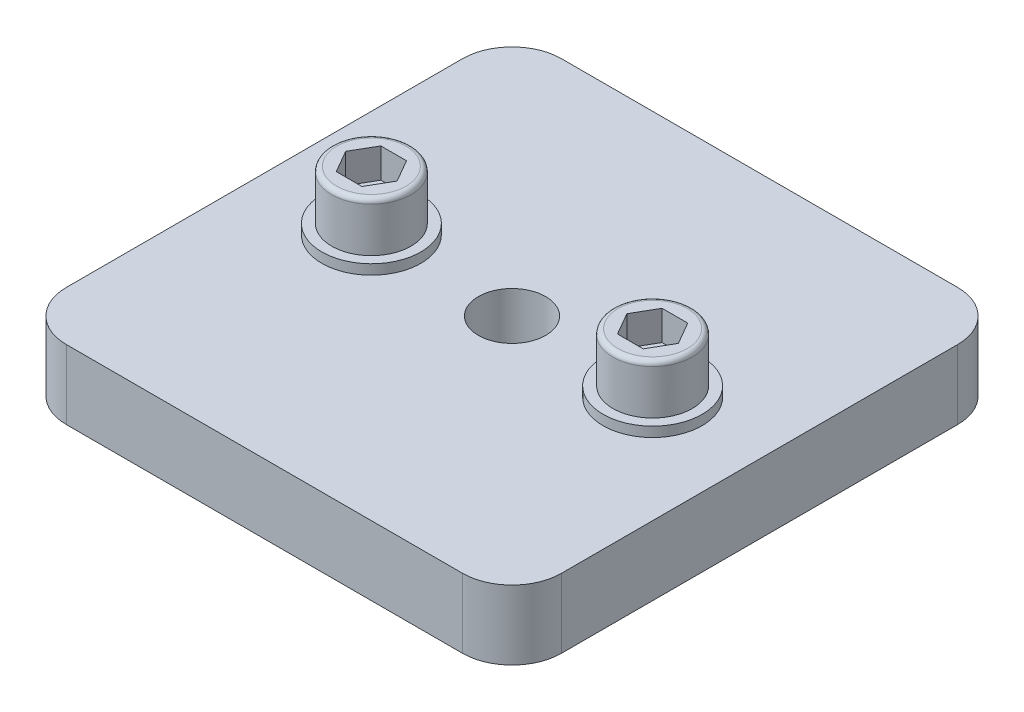
ISO-10303-21;
HEADER;
FILE_DESCRIPTION(('STEP AP214'),'2;1');
FILE_NAME('part.step','',(''),(''),'','','');
FILE_SCHEMA(('AUTOMOTIVE_DESIGN { 1 0 10303 214 1 1 1 1 }'));
ENDSEC;
DATA;
#1=APPLICATION_CONTEXT('core data for automotive mechanical design processes');
#2=APPLICATION_PROTOCOL_DEFINITION('international standard','automotive_design',2000,#1);
#3=PRODUCT_CONTEXT('',#1,'mechanical');
#4=PRODUCT('Part','Part','',(#3));
#5=PRODUCT_RELATED_PRODUCT_CATEGORY('part','',(#4));
#6=PRODUCT_DEFINITION_FORMATION('','',#4);
#7=PRODUCT_DEFINITION_CONTEXT('part definition',#1,'design');
#8=PRODUCT_DEFINITION('design','',#6,#7);
#9=PRODUCT_DEFINITION_SHAPE('','',#8);
#10=(LENGTH_UNIT() NAMED_UNIT(*) SI_UNIT(.MILLI.,.METRE.));
#11=(NAMED_UNIT(*) PLANE_ANGLE_UNIT() SI_UNIT($,.RADIAN.));
#12=(NAMED_UNIT(*) SI_UNIT($,.STERADIAN.) SOLID_ANGLE_UNIT());
#13=UNCERTAINTY_MEASURE_WITH_UNIT(LENGTH_MEASURE(1.E-05),#10,'distance_accuracy_value','');
#14=(GEOMETRIC_REPRESENTATION_CONTEXT(3) GLOBAL_UNCERTAINTY_ASSIGNED_CONTEXT((#13)) GLOBAL_UNIT_ASSIGNED_CONTEXT((#10,
#11,#12)) REPRESENTATION_CONTEXT('',''));
#15=CARTESIAN_POINT('',(0.,0.,0.));
#16=DIRECTION('',(0.,0.,1.));
#17=DIRECTION('',(1.,0.,0.));
#18=AXIS2_PLACEMENT_3D('',#15,#16,#17);
#19=CARTESIAN_POINT('',(-20.,7.,-20.));
#20=DIRECTION('',(0.,1.,0.));
#21=DIRECTION('',(0.,0.,1.));
#22=AXIS2_PLACEMENT_3D('',#19,#20,#21);
#23=PLANE('',#22);
#24=CARTESIAN_POINT('',(-20.,7.,-20.));
#25=DIRECTION('',(0.,1.,0.));
#26=DIRECTION('',(0.,0.,1.));
#27=AXIS2_PLACEMENT_3D('',#24,#25,#26);
#28=CIRCLE('',#27,5.);
#29=CARTESIAN_POINT('',(-20.,7.,-25.));
#30=VERTEX_POINT('',#29);
#31=CARTESIAN_POINT('',(-25.,7.,-20.));
#32=VERTEX_POINT('',#31);
#33=EDGE_CURVE('E297',#30,#32,#28,.T.);
#34=ORIENTED_EDGE('',*,*,#33,.T.);
#35=DIRECTION('',(0.,0.,1.));
#36=VECTOR('',#35,1.);
#37=CARTESIAN_POINT('',(-25.,7.,20.));
#38=LINE('',#37,#36);
#39=CARTESIAN_POINT('',(-25.,7.,20.));
#40=VERTEX_POINT('',#39);
#41=EDGE_CURVE('E299',#32,#40,#38,.T.);
#42=ORIENTED_EDGE('',*,*,#41,.T.);
#43=CARTESIAN_POINT('',(-20.,7.,20.));
#44=DIRECTION('',(0.,1.,0.));
#45=DIRECTION('',(0.,0.,-1.));
#46=AXIS2_PLACEMENT_3D('',#43,#44,#45);
#47=CIRCLE('',#46,5.);
#48=CARTESIAN_POINT('',(-20.,7.,25.));
#49=VERTEX_POINT('',#48);
#50=EDGE_CURVE('E302',#40,#49,#47,.T.);
#51=ORIENTED_EDGE('',*,*,#50,.T.);
#52=DIRECTION('',(1.,0.,0.));
#53=VECTOR('',#52,1.);
#54=CARTESIAN_POINT('',(20.,7.,25.));
#55=LINE('',#54,#53);
#56=CARTESIAN_POINT('',(20.,7.,25.));
#57=VERTEX_POINT('',#56);
#58=EDGE_CURVE('E304',#49,#57,#55,.T.);
#59=ORIENTED_EDGE('',*,*,#58,.T.);
#60=CARTESIAN_POINT('',(20.,7.,20.));
#61=DIRECTION('',(0.,1.,0.));
#62=DIRECTION('',(0.,0.,1.));
#63=AXIS2_PLACEMENT_3D('',#60,#61,#62);
#64=CIRCLE('',#63,5.);
#65=CARTESIAN_POINT('',(25.,7.,20.));
#66=VERTEX_POINT('',#65);
#67=EDGE_CURVE('E306',#57,#66,#64,.T.);
#68=ORIENTED_EDGE('',*,*,#67,.T.);
#69=DIRECTION('',(0.,0.,-1.));
#70=VECTOR('',#69,1.);
#71=CARTESIAN_POINT('',(25.,7.,20.));
#72=LINE('',#71,#70);
#73=CARTESIAN_POINT('',(25.,7.,-20.));
#74=VERTEX_POINT('',#73);
#75=EDGE_CURVE('E308',#66,#74,#72,.T.);
#76=ORIENTED_EDGE('',*,*,#75,.T.);
#77=CARTESIAN_POINT('',(20.,7.,-20.));
#78=DIRECTION('',(0.,1.,0.));
#79=DIRECTION('',(0.,0.,1.));
#80=AXIS2_PLACEMENT_3D('',#77,#78,#79);
#81=CIRCLE('',#80,5.);
#82=CARTESIAN_POINT('',(20.,7.,-25.));
#83=VERTEX_POINT('',#82);
#84=EDGE_CURVE('E310',#74,#83,#81,.T.);
#85=ORIENTED_EDGE('',*,*,#84,.T.);
#86=DIRECTION('',(-1.,0.,0.));
#87=VECTOR('',#86,1.);
#88=CARTESIAN_POINT('',(20.,7.,-25.));
#89=LINE('',#88,#87);
#90=EDGE_CURVE('E312',#83,#30,#89,.T.);
#91=ORIENTED_EDGE('',*,*,#90,.T.);
#92=EDGE_LOOP('',(#34,#42,#51,#59,#68,#76,#85,#91));
#93=FACE_BOUND('',#92,.T.);
#94=CARTESIAN_POINT('',(-14.2,7.,0.));
#95=DIRECTION('',(0.,1.,0.));
#96=DIRECTION('',(-1.,0.,0.));
#97=AXIS2_PLACEMENT_3D('',#94,#95,#96);
#98=CIRCLE('',#97,5.);
#99=CARTESIAN_POINT('',(-19.2,7.,0.));
#100=VERTEX_POINT('',#99);
#101=EDGE_CURVE('E218',#100,#100,#98,.T.);
#102=ORIENTED_EDGE('',*,*,#101,.F.);
#103=EDGE_LOOP('',(#102));
#104=FACE_BOUND('',#103,.T.);
#105=CARTESIAN_POINT('',(14.2,7.,0.));
#106=DIRECTION('',(0.,1.,0.));
#107=DIRECTION('',(-1.,0.,0.));
#108=AXIS2_PLACEMENT_3D('',#105,#106,#107);
#109=CIRCLE('',#108,5.);
#110=CARTESIAN_POINT('',(9.2,7.,0.));
#111=VERTEX_POINT('',#110);
#112=EDGE_CURVE('E282',#111,#111,#109,.T.);
#113=ORIENTED_EDGE('',*,*,#112,.F.);
#114=EDGE_LOOP('',(#113));
#115=FACE_BOUND('',#114,.T.);
#116=CARTESIAN_POINT('',(0.,7.,0.));
#117=DIRECTION('',(0.,1.,0.));
#118=DIRECTION('',(0.,0.,1.));
#119=AXIS2_PLACEMENT_3D('',#116,#117,#118);
#120=CIRCLE('',#119,3.4);
#121=CARTESIAN_POINT('',(0.,7.,3.4));
#122=VERTEX_POINT('',#121);
#123=EDGE_CURVE('E288',#122,#122,#120,.T.);
#124=ORIENTED_EDGE('',*,*,#123,.F.);
#125=EDGE_LOOP('',(#124));
#126=FACE_BOUND('',#125,.T.);
#127=ADVANCED_FACE('F33',(#93,#104,#115,#126),#23,.T.);
#128=CARTESIAN_POINT('',(-20.,0.,-20.));
#129=DIRECTION('',(0.,1.,0.));
#130=DIRECTION('',(0.,0.,1.));
#131=AXIS2_PLACEMENT_3D('',#128,#129,#130);
#132=PLANE('',#131);
#133=CARTESIAN_POINT('',(0.,0.,0.));
#134=DIRECTION('',(0.,1.,0.));
#135=DIRECTION('',(0.,0.,1.));
#136=AXIS2_PLACEMENT_3D('',#133,#134,#135);
#137=CIRCLE('',#136,3.4);
#138=CARTESIAN_POINT('',(0.,0.,3.4));
#139=VERTEX_POINT('',#138);
#140=EDGE_CURVE('E291',#139,#139,#137,.T.);
#141=ORIENTED_EDGE('',*,*,#140,.T.);
#142=EDGE_LOOP('',(#141));
#143=FACE_BOUND('',#142,.T.);
#144=CARTESIAN_POINT('',(-20.,0.,-20.));
#145=DIRECTION('',(0.,1.,0.));
#146=DIRECTION('',(0.,0.,1.));
#147=AXIS2_PLACEMENT_3D('',#144,#145,#146);
#148=CIRCLE('',#147,5.);
#149=CARTESIAN_POINT('',(-20.,0.,-25.));
#150=VERTEX_POINT('',#149);
#151=CARTESIAN_POINT('',(-25.,0.,-20.));
#152=VERTEX_POINT('',#151);
#153=EDGE_CURVE('E294',#150,#152,#148,.T.);
#154=ORIENTED_EDGE('',*,*,#153,.F.);
#155=DIRECTION('',(-1.,0.,0.));
#156=VECTOR('',#155,1.);
#157=CARTESIAN_POINT('',(20.,0.,-25.));
#158=LINE('',#157,#156);
#159=CARTESIAN_POINT('',(20.,0.,-25.));
#160=VERTEX_POINT('',#159);
#161=EDGE_CURVE('E300',#160,#150,#158,.T.);
#162=ORIENTED_EDGE('',*,*,#161,.F.);
#163=CARTESIAN_POINT('',(20.,0.,-20.));
#164=DIRECTION('',(0.,1.,0.));
#165=DIRECTION('',(0.,0.,1.));
#166=AXIS2_PLACEMENT_3D('',#163,#164,#165);
#167=CIRCLE('',#166,5.);
#168=CARTESIAN_POINT('',(25.,0.,-20.));
#169=VERTEX_POINT('',#168);
#170=EDGE_CURVE('E327',#169,#160,#167,.T.);
#171=ORIENTED_EDGE('',*,*,#170,.F.);
#172=DIRECTION('',(0.,0.,-1.));
#173=VECTOR('',#172,1.);
#174=CARTESIAN_POINT('',(25.,0.,20.));
#175=LINE('',#174,#173);
#176=CARTESIAN_POINT('',(25.,0.,20.));
#177=VERTEX_POINT('',#176);
#178=EDGE_CURVE('E325',#177,#169,#175,.T.);
#179=ORIENTED_EDGE('',*,*,#178,.F.);
#180=CARTESIAN_POINT('',(20.,0.,20.));
#181=DIRECTION('',(0.,1.,0.));
#182=DIRECTION('',(0.,0.,1.));
#183=AXIS2_PLACEMENT_3D('',#180,#181,#182);
#184=CIRCLE('',#183,5.);
#185=CARTESIAN_POINT('',(20.,0.,25.));
#186=VERTEX_POINT('',#185);
#187=EDGE_CURVE('E323',#186,#177,#184,.T.);
#188=ORIENTED_EDGE('',*,*,#187,.F.);
#189=DIRECTION('',(1.,0.,0.));
#190=VECTOR('',#189,1.);
#191=CARTESIAN_POINT('',(20.,0.,25.));
#192=LINE('',#191,#190);
#193=CARTESIAN_POINT('',(-20.,0.,25.));
#194=VERTEX_POINT('',#193);
#195=EDGE_CURVE('E321',#194,#186,#192,.T.);
#196=ORIENTED_EDGE('',*,*,#195,.F.);
#197=CARTESIAN_POINT('',(-20.,0.,20.));
#198=DIRECTION('',(0.,1.,0.));
#199=DIRECTION('',(0.,0.,-1.));
#200=AXIS2_PLACEMENT_3D('',#197,#198,#199);
#201=CIRCLE('',#200,5.);
#202=CARTESIAN_POINT('',(-25.,0.,20.));
#203=VERTEX_POINT('',#202);
#204=EDGE_CURVE('E319',#203,#194,#201,.T.);
#205=ORIENTED_EDGE('',*,*,#204,.F.);
#206=DIRECTION('',(0.,0.,1.));
#207=VECTOR('',#206,1.);
#208=CARTESIAN_POINT('',(-25.,0.,20.));
#209=LINE('',#208,#207);
#210=EDGE_CURVE('E317',#152,#203,#209,.T.);
#211=ORIENTED_EDGE('',*,*,#210,.F.);
#212=EDGE_LOOP('',(#154,#162,#171,#179,#188,#196,#205,#211));
#213=FACE_BOUND('',#212,.T.);
#214=ADVANCED_FACE('F371',(#143,#213),#132,.F.);
#215=CARTESIAN_POINT('',(-20.,7.,-20.));
#216=DIRECTION('',(0.,-1.,0.));
#217=DIRECTION('',(0.,0.,-1.));
#218=AXIS2_PLACEMENT_3D('',#215,#216,#217);
#219=CYLINDRICAL_SURFACE('',#218,5.);
#220=ORIENTED_EDGE('',*,*,#153,.T.);
#221=DIRECTION('',(0.,-1.,0.));
#222=VECTOR('',#221,1.);
#223=CARTESIAN_POINT('',(-25.,7.,-20.));
#224=LINE('',#223,#222);
#225=EDGE_CURVE('E278',#32,#152,#224,.T.);
#226=ORIENTED_EDGE('',*,*,#225,.F.);
#227=ORIENTED_EDGE('',*,*,#33,.F.);
#228=DIRECTION('',(0.,-1.,0.));
#229=VECTOR('',#228,1.);
#230=CARTESIAN_POINT('',(-20.,7.,-25.));
#231=LINE('',#230,#229);
#232=EDGE_CURVE('E314',#30,#150,#231,.T.);
#233=ORIENTED_EDGE('',*,*,#232,.T.);
#234=EDGE_LOOP('',(#220,#226,#227,#233));
#235=FACE_BOUND('',#234,.T.);
#236=ADVANCED_FACE('F379',(#235),#219,.T.);
#237=CARTESIAN_POINT('',(-25.,7.,20.));
#238=DIRECTION('',(1.,0.,0.));
#239=DIRECTION('',(0.,0.,-1.));
#240=AXIS2_PLACEMENT_3D('',#237,#238,#239);
#241=PLANE('',#240);
#242=ORIENTED_EDGE('',*,*,#210,.T.);
#243=DIRECTION('',(0.,-1.,0.));
#244=VECTOR('',#243,1.);
#245=CARTESIAN_POINT('',(-25.,7.,20.));
#246=LINE('',#245,#244);
#247=EDGE_CURVE('E347',#40,#203,#246,.T.);
#248=ORIENTED_EDGE('',*,*,#247,.F.);
#249=ORIENTED_EDGE('',*,*,#41,.F.);
#250=ORIENTED_EDGE('',*,*,#225,.T.);
#251=EDGE_LOOP('',(#242,#248,#249,#250));
#252=FACE_BOUND('',#251,.T.);
#253=ADVANCED_FACE('F410',(#252),#241,.F.);
#254=CARTESIAN_POINT('',(-20.,7.,20.));
#255=DIRECTION('',(0.,-1.,0.));
#256=DIRECTION('',(0.,0.,-1.));
#257=AXIS2_PLACEMENT_3D('',#254,#255,#256);
#258=CYLINDRICAL_SURFACE('',#257,5.);
#259=ORIENTED_EDGE('',*,*,#204,.T.);
#260=DIRECTION('',(0.,-1.,0.));
#261=VECTOR('',#260,1.);
#262=CARTESIAN_POINT('',(-20.,7.,25.));
#263=LINE('',#262,#261);
#264=EDGE_CURVE('E344',#49,#194,#263,.T.);
#265=ORIENTED_EDGE('',*,*,#264,.F.);
#266=ORIENTED_EDGE('',*,*,#50,.F.);
#267=ORIENTED_EDGE('',*,*,#247,.T.);
#268=EDGE_LOOP('',(#259,#265,#266,#267));
#269=FACE_BOUND('',#268,.T.);
#270=ADVANCED_FACE('F406',(#269),#258,.T.);
#271=CARTESIAN_POINT('',(20.,7.,25.));
#272=DIRECTION('',(0.,0.,-1.));
#273=DIRECTION('',(-1.,0.,0.));
#274=AXIS2_PLACEMENT_3D('',#271,#272,#273);
#275=PLANE('',#274);
#276=ORIENTED_EDGE('',*,*,#195,.T.);
#277=DIRECTION('',(0.,-1.,0.));
#278=VECTOR('',#277,1.);
#279=CARTESIAN_POINT('',(20.,7.,25.));
#280=LINE('',#279,#278);
#281=EDGE_CURVE('E341',#57,#186,#280,.T.);
#282=ORIENTED_EDGE('',*,*,#281,.F.);
#283=ORIENTED_EDGE('',*,*,#58,.F.);
#284=ORIENTED_EDGE('',*,*,#264,.T.);
#285=EDGE_LOOP('',(#276,#282,#283,#284));
#286=FACE_BOUND('',#285,.T.);
#287=ADVANCED_FACE('F402',(#286),#275,.F.);
#288=CARTESIAN_POINT('',(20.,7.,20.));
#289=DIRECTION('',(0.,-1.,0.));
#290=DIRECTION('',(0.,0.,-1.));
#291=AXIS2_PLACEMENT_3D('',#288,#289,#290);
#292=CYLINDRICAL_SURFACE('',#291,5.);
#293=ORIENTED_EDGE('',*,*,#187,.T.);
#294=DIRECTION('',(0.,-1.,0.));
#295=VECTOR('',#294,1.);
#296=CARTESIAN_POINT('',(25.,7.,20.));
#297=LINE('',#296,#295);
#298=EDGE_CURVE('E338',#66,#177,#297,.T.);
#299=ORIENTED_EDGE('',*,*,#298,.F.);
#300=ORIENTED_EDGE('',*,*,#67,.F.);
#301=ORIENTED_EDGE('',*,*,#281,.T.);
#302=EDGE_LOOP('',(#293,#299,#300,#301));
#303=FACE_BOUND('',#302,.T.);
#304=ADVANCED_FACE('F398',(#303),#292,.T.);
#305=CARTESIAN_POINT('',(25.,7.,20.));
#306=DIRECTION('',(-1.,0.,0.));
#307=DIRECTION('',(0.,0.,1.));
#308=AXIS2_PLACEMENT_3D('',#305,#306,#307);
#309=PLANE('',#308);
#310=ORIENTED_EDGE('',*,*,#178,.T.);
#311=DIRECTION('',(0.,-1.,0.));
#312=VECTOR('',#311,1.);
#313=CARTESIAN_POINT('',(25.,7.,-20.));
#314=LINE('',#313,#312);
#315=EDGE_CURVE('E335',#74,#169,#314,.T.);
#316=ORIENTED_EDGE('',*,*,#315,.F.);
#317=ORIENTED_EDGE('',*,*,#75,.F.);
#318=ORIENTED_EDGE('',*,*,#298,.T.);
#319=EDGE_LOOP('',(#310,#316,#317,#318));
#320=FACE_BOUND('',#319,.T.);
#321=ADVANCED_FACE('F394',(#320),#309,.F.);
#322=CARTESIAN_POINT('',(20.,7.,-20.));
#323=DIRECTION('',(0.,-1.,0.));
#324=DIRECTION('',(0.,0.,-1.));
#325=AXIS2_PLACEMENT_3D('',#322,#323,#324);
#326=CYLINDRICAL_SURFACE('',#325,5.);
#327=ORIENTED_EDGE('',*,*,#170,.T.);
#328=DIRECTION('',(0.,-1.,0.));
#329=VECTOR('',#328,1.);
#330=CARTESIAN_POINT('',(20.,7.,-25.));
#331=LINE('',#330,#329);
#332=EDGE_CURVE('E332',#83,#160,#331,.T.);
#333=ORIENTED_EDGE('',*,*,#332,.F.);
#334=ORIENTED_EDGE('',*,*,#84,.F.);
#335=ORIENTED_EDGE('',*,*,#315,.T.);
#336=EDGE_LOOP('',(#327,#333,#334,#335));
#337=FACE_BOUND('',#336,.T.);
#338=ADVANCED_FACE('F390',(#337),#326,.T.);
#339=CARTESIAN_POINT('',(20.,7.,-25.));
#340=DIRECTION('',(0.,0.,1.));
#341=DIRECTION('',(1.,0.,0.));
#342=AXIS2_PLACEMENT_3D('',#339,#340,#341);
#343=PLANE('',#342);
#344=ORIENTED_EDGE('',*,*,#161,.T.);
#345=ORIENTED_EDGE('',*,*,#232,.F.);
#346=ORIENTED_EDGE('',*,*,#90,.F.);
#347=ORIENTED_EDGE('',*,*,#332,.T.);
#348=EDGE_LOOP('',(#344,#345,#346,#347));
#349=FACE_BOUND('',#348,.T.);
#350=ADVANCED_FACE('F387',(#349),#343,.F.);
#351=CARTESIAN_POINT('',(0.,0.,0.));
#352=DIRECTION('',(0.,1.,0.));
#353=DIRECTION('',(0.,0.,1.));
#354=AXIS2_PLACEMENT_3D('',#351,#352,#353);
#355=CYLINDRICAL_SURFACE('',#354,3.4);
#356=ORIENTED_EDGE('',*,*,#140,.F.);
#357=EDGE_LOOP('',(#356));
#358=FACE_BOUND('',#357,.T.);
#359=ORIENTED_EDGE('',*,*,#123,.T.);
#360=EDGE_LOOP('',(#359));
#361=FACE_BOUND('',#360,.T.);
#362=ADVANCED_FACE('F384',(#358,#361),#355,.F.);
#363=CARTESIAN_POINT('',(14.2,8.,0.));
#364=DIRECTION('',(0.,-1.,0.));
#365=DIRECTION('',(0.,0.,-1.));
#366=AXIS2_PLACEMENT_3D('',#363,#364,#365);
#367=CYLINDRICAL_SURFACE('',#366,5.);
#368=CARTESIAN_POINT('',(14.2,8.,0.));
#369=DIRECTION('',(0.,1.,0.));
#370=DIRECTION('',(-1.,0.,0.));
#371=AXIS2_PLACEMENT_3D('',#368,#369,#370);
#372=CIRCLE('',#371,5.);
#373=CARTESIAN_POINT('',(9.2,8.,0.));
#374=VERTEX_POINT('',#373);
#375=EDGE_CURVE('E285',#374,#374,#372,.T.);
#376=ORIENTED_EDGE('',*,*,#375,.F.);
#377=EDGE_LOOP('',(#376));
#378=FACE_BOUND('',#377,.T.);
#379=ORIENTED_EDGE('',*,*,#112,.T.);
#380=EDGE_LOOP('',(#379));
#381=FACE_BOUND('',#380,.T.);
#382=ADVANCED_FACE('F476',(#378,#381),#367,.T.);
#383=CARTESIAN_POINT('',(14.2,8.,0.));
#384=DIRECTION('',(0.,1.,0.));
#385=DIRECTION('',(-1.,0.,0.));
#386=AXIS2_PLACEMENT_3D('',#383,#384,#385);
#387=PLANE('',#386);
#388=CARTESIAN_POINT('',(14.2,8.,0.));
#389=DIRECTION('',(0.,1.,0.));
#390=DIRECTION('',(-1.,0.,0.));
#391=AXIS2_PLACEMENT_3D('',#388,#389,#390);
#392=CIRCLE('',#391,4.);
#393=CARTESIAN_POINT('',(10.2,8.,0.));
#394=VERTEX_POINT('',#393);
#395=EDGE_CURVE('E275',#394,#394,#392,.T.);
#396=ORIENTED_EDGE('',*,*,#395,.F.);
#397=EDGE_LOOP('',(#396));
#398=FACE_BOUND('',#397,.T.);
#399=ORIENTED_EDGE('',*,*,#375,.T.);
#400=EDGE_LOOP('',(#399));
#401=FACE_BOUND('',#400,.T.);
#402=ADVANCED_FACE('F500',(#398,#401),#387,.T.);
#403=CARTESIAN_POINT('',(-14.2,8.,0.));
#404=DIRECTION('',(0.,-1.,0.));
#405=DIRECTION('',(0.,0.,-1.));
#406=AXIS2_PLACEMENT_3D('',#403,#404,#405);
#407=CYLINDRICAL_SURFACE('',#406,5.);
#408=CARTESIAN_POINT('',(-14.2,8.,0.));
#409=DIRECTION('',(0.,1.,0.));
#410=DIRECTION('',(-1.,0.,0.));
#411=AXIS2_PLACEMENT_3D('',#408,#409,#410);
#412=CIRCLE('',#411,5.);
#413=CARTESIAN_POINT('',(-19.2,8.,0.));
#414=VERTEX_POINT('',#413);
#415=EDGE_CURVE('E279',#414,#414,#412,.T.);
#416=ORIENTED_EDGE('',*,*,#415,.F.);
#417=EDGE_LOOP('',(#416));
#418=FACE_BOUND('',#417,.T.);
#419=ORIENTED_EDGE('',*,*,#101,.T.);
#420=EDGE_LOOP('',(#419));
#421=FACE_BOUND('',#420,.T.);
#422=ADVANCED_FACE('F509',(#418,#421),#407,.T.);
#423=CARTESIAN_POINT('',(-14.2,8.,0.));
#424=DIRECTION('',(0.,1.,0.));
#425=DIRECTION('',(-1.,0.,0.));
#426=AXIS2_PLACEMENT_3D('',#423,#424,#425);
#427=PLANE('',#426);
#428=CARTESIAN_POINT('',(-14.2,8.,0.));
#429=DIRECTION('',(0.,1.,0.));
#430=DIRECTION('',(-1.,0.,0.));
#431=AXIS2_PLACEMENT_3D('',#428,#429,#430);
#432=CIRCLE('',#431,4.);
#433=CARTESIAN_POINT('',(-18.2,8.,0.));
#434=VERTEX_POINT('',#433);
#435=EDGE_CURVE('E271',#434,#434,#432,.T.);
#436=ORIENTED_EDGE('',*,*,#435,.F.);
#437=EDGE_LOOP('',(#436));
#438=FACE_BOUND('',#437,.T.);
#439=ORIENTED_EDGE('',*,*,#415,.T.);
#440=EDGE_LOOP('',(#439));
#441=FACE_BOUND('',#440,.T.);
#442=ADVANCED_FACE('F519',(#438,#441),#427,.T.);
#443=CARTESIAN_POINT('',(14.2,13.,0.));
#444=DIRECTION('',(0.,-1.,0.));
#445=DIRECTION('',(0.,0.,-1.));
#446=AXIS2_PLACEMENT_3D('',#443,#444,#445);
#447=CYLINDRICAL_SURFACE('',#446,4.);
#448=CARTESIAN_POINT('',(14.2,12.5,0.));
#449=DIRECTION('',(0.,1.,0.));
#450=DIRECTION('',(0.,0.,1.));
#451=AXIS2_PLACEMENT_3D('',#448,#449,#450);
#452=CIRCLE('',#451,4.);
#453=CARTESIAN_POINT('',(14.2,12.5,4.00000000000005));
#454=VERTEX_POINT('',#453);
#455=EDGE_CURVE('E11',#454,#454,#452,.F.);
#456=ORIENTED_EDGE('',*,*,#455,.T.);
#457=EDGE_LOOP('',(#456));
#458=FACE_BOUND('',#457,.T.);
#459=ORIENTED_EDGE('',*,*,#395,.T.);
#460=EDGE_LOOP('',(#459));
#461=FACE_BOUND('',#460,.T.);
#462=ADVANCED_FACE('F529',(#458,#461),#447,.T.);
#463=CARTESIAN_POINT('',(14.2,13.,0.));
#464=DIRECTION('',(0.,1.,0.));
#465=DIRECTION('',(-1.,0.,0.));
#466=AXIS2_PLACEMENT_3D('',#463,#464,#465);
#467=PLANE('',#466);
#468=CARTESIAN_POINT('',(14.2,13.,0.));
#469=DIRECTION('',(0.,1.,0.));
#470=DIRECTION('',(0.,0.,1.));
#471=AXIS2_PLACEMENT_3D('',#468,#469,#470);
#472=CIRCLE('',#471,3.5);
#473=CARTESIAN_POINT('',(14.2,13.,3.50000000000005));
#474=VERTEX_POINT('',#473);
#475=EDGE_CURVE('E41',#474,#474,#472,.T.);
#476=ORIENTED_EDGE('',*,*,#475,.T.);
#477=EDGE_LOOP('',(#476));
#478=FACE_BOUND('',#477,.T.);
#479=DIRECTION('',(0.500000000000003,0.,-0.866025403784437));
#480=VECTOR('',#479,1.);
#481=CARTESIAN_POINT('',(15.4990381056767,13.,2.25000000000005));
#482=LINE('',#481,#480);
#483=CARTESIAN_POINT('',(15.4990381056767,13.,2.25000000000005));
#484=VERTEX_POINT('',#483);
#485=CARTESIAN_POINT('',(16.7980762113533,13.,0.));
#486=VERTEX_POINT('',#485);
#487=EDGE_CURVE('E48',#484,#486,#482,.T.);
#488=ORIENTED_EDGE('',*,*,#487,.F.);
#489=DIRECTION('',(1.,0.,0.));
#490=VECTOR('',#489,1.);
#491=CARTESIAN_POINT('',(12.9009618943233,13.,2.25000000000005));
#492=LINE('',#491,#490);
#493=CARTESIAN_POINT('',(12.9009618943233,13.,2.25000000000005));
#494=VERTEX_POINT('',#493);
#495=EDGE_CURVE('E191',#494,#484,#492,.T.);
#496=ORIENTED_EDGE('',*,*,#495,.F.);
#497=DIRECTION('',(0.499999999999997,0.,0.86602540378444));
#498=VECTOR('',#497,1.);
#499=CARTESIAN_POINT('',(11.6019237886467,13.,0.));
#500=LINE('',#499,#498);
#501=CARTESIAN_POINT('',(11.6019237886467,13.,0.));
#502=VERTEX_POINT('',#501);
#503=EDGE_CURVE('E194',#502,#494,#500,.T.);
#504=ORIENTED_EDGE('',*,*,#503,.F.);
#505=DIRECTION('',(-0.500000000000003,0.,0.866025403784437));
#506=VECTOR('',#505,1.);
#507=CARTESIAN_POINT('',(12.9009618943234,13.,-2.24999999999995));
#508=LINE('',#507,#506);
#509=CARTESIAN_POINT('',(12.9009618943234,13.,-2.24999999999995));
#510=VERTEX_POINT('',#509);
#511=EDGE_CURVE('E211',#510,#502,#508,.T.);
#512=ORIENTED_EDGE('',*,*,#511,.F.);
#513=DIRECTION('',(-1.,0.,0.));
#514=VECTOR('',#513,1.);
#515=CARTESIAN_POINT('',(15.4990381056767,13.,-2.24999999999994));
#516=LINE('',#515,#514);
#517=CARTESIAN_POINT('',(15.4990381056767,13.,-2.24999999999994));
#518=VERTEX_POINT('',#517);
#519=EDGE_CURVE('E208',#518,#510,#516,.T.);
#520=ORIENTED_EDGE('',*,*,#519,.F.);
#521=DIRECTION('',(-0.499999999999998,0.,-0.86602540378444));
#522=VECTOR('',#521,1.);
#523=CARTESIAN_POINT('',(16.7980762113533,13.,0.));
#524=LINE('',#523,#522);
#525=EDGE_CURVE('E205',#486,#518,#524,.T.);
#526=ORIENTED_EDGE('',*,*,#525,.F.);
#527=EDGE_LOOP('',(#488,#496,#504,#512,#520,#526));
#528=FACE_BOUND('',#527,.T.);
#529=ADVANCED_FACE('F359',(#478,#528),#467,.T.);
#530=CARTESIAN_POINT('',(-14.2,13.,0.));
#531=DIRECTION('',(0.,-1.,0.));
#532=DIRECTION('',(0.,0.,-1.));
#533=AXIS2_PLACEMENT_3D('',#530,#531,#532);
#534=CYLINDRICAL_SURFACE('',#533,4.);
#535=CARTESIAN_POINT('',(-14.2,12.5,0.));
#536=DIRECTION('',(0.,1.,0.));
#537=DIRECTION('',(0.,0.,1.));
#538=AXIS2_PLACEMENT_3D('',#535,#536,#537);
#539=CIRCLE('',#538,4.);
#540=CARTESIAN_POINT('',(-14.2,12.5,3.99999999999995));
#541=VERTEX_POINT('',#540);
#542=EDGE_CURVE('E354',#541,#541,#539,.F.);
#543=ORIENTED_EDGE('',*,*,#542,.T.);
#544=EDGE_LOOP('',(#543));
#545=FACE_BOUND('',#544,.T.);
#546=ORIENTED_EDGE('',*,*,#435,.T.);
#547=EDGE_LOOP('',(#546));
#548=FACE_BOUND('',#547,.T.);
#549=ADVANCED_FACE('F548',(#545,#548),#534,.T.);
#550=CARTESIAN_POINT('',(-14.2,13.,0.));
#551=DIRECTION('',(0.,1.,0.));
#552=DIRECTION('',(-1.,0.,0.));
#553=AXIS2_PLACEMENT_3D('',#550,#551,#552);
#554=PLANE('',#553);
#555=CARTESIAN_POINT('',(-14.2,13.,0.));
#556=DIRECTION('',(0.,1.,0.));
#557=DIRECTION('',(0.,0.,1.));
#558=AXIS2_PLACEMENT_3D('',#555,#556,#557);
#559=CIRCLE('',#558,3.5);
#560=CARTESIAN_POINT('',(-14.2,13.,3.49999999999995));
#561=VERTEX_POINT('',#560);
#562=EDGE_CURVE('E274',#561,#561,#559,.T.);
#563=ORIENTED_EDGE('',*,*,#562,.T.);
#564=EDGE_LOOP('',(#563));
#565=FACE_BOUND('',#564,.T.);
#566=DIRECTION('',(0.500000000000003,0.,-0.866025403784437));
#567=VECTOR('',#566,1.);
#568=CARTESIAN_POINT('',(-12.9009618943233,13.,2.24999999999995));
#569=LINE('',#568,#567);
#570=CARTESIAN_POINT('',(-12.9009618943233,13.,2.24999999999995));
#571=VERTEX_POINT('',#570);
#572=CARTESIAN_POINT('',(-11.6019237886467,13.,0.));
#573=VERTEX_POINT('',#572);
#574=EDGE_CURVE('E56',#571,#573,#569,.T.);
#575=ORIENTED_EDGE('',*,*,#574,.F.);
#576=DIRECTION('',(1.,0.,0.));
#577=VECTOR('',#576,1.);
#578=CARTESIAN_POINT('',(-15.4990381056767,13.,2.24999999999995));
#579=LINE('',#578,#577);
#580=CARTESIAN_POINT('',(-15.4990381056767,13.,2.24999999999995));
#581=VERTEX_POINT('',#580);
#582=EDGE_CURVE('E230',#581,#571,#579,.T.);
#583=ORIENTED_EDGE('',*,*,#582,.F.);
#584=DIRECTION('',(0.499999999999997,0.,0.86602540378444));
#585=VECTOR('',#584,1.);
#586=CARTESIAN_POINT('',(-16.7980762113533,13.,0.));
#587=LINE('',#586,#585);
#588=CARTESIAN_POINT('',(-16.7980762113533,13.,0.));
#589=VERTEX_POINT('',#588);
#590=EDGE_CURVE('E256',#589,#581,#587,.T.);
#591=ORIENTED_EDGE('',*,*,#590,.F.);
#592=DIRECTION('',(-0.500000000000004,0.,0.866025403784436));
#593=VECTOR('',#592,1.);
#594=CARTESIAN_POINT('',(-15.4990381056766,13.,-2.25000000000005));
#595=LINE('',#594,#593);
#596=CARTESIAN_POINT('',(-15.4990381056766,13.,-2.25000000000005));
#597=VERTEX_POINT('',#596);
#598=EDGE_CURVE('E253',#597,#589,#595,.T.);
#599=ORIENTED_EDGE('',*,*,#598,.F.);
#600=DIRECTION('',(-1.,0.,0.));
#601=VECTOR('',#600,1.);
#602=CARTESIAN_POINT('',(-12.9009618943233,13.,-2.25000000000004));
#603=LINE('',#602,#601);
#604=CARTESIAN_POINT('',(-12.9009618943233,13.,-2.25000000000004));
#605=VERTEX_POINT('',#604);
#606=EDGE_CURVE('E250',#605,#597,#603,.T.);
#607=ORIENTED_EDGE('',*,*,#606,.F.);
#608=DIRECTION('',(-0.499999999999997,0.,-0.86602540378444));
#609=VECTOR('',#608,1.);
#610=CARTESIAN_POINT('',(-11.6019237886467,13.,0.));
#611=LINE('',#610,#609);
#612=EDGE_CURVE('E247',#573,#605,#611,.T.);
#613=ORIENTED_EDGE('',*,*,#612,.F.);
#614=EDGE_LOOP('',(#575,#583,#591,#599,#607,#613));
#615=FACE_BOUND('',#614,.T.);
#616=ADVANCED_FACE('F557',(#565,#615),#554,.T.);
#617=CARTESIAN_POINT('',(-12.9009618943233,10.,2.24999999999995));
#618=DIRECTION('',(0.866025403784437,0.,0.500000000000003));
#619=DIRECTION('',(0.500000000000003,0.,-0.866025403784437));
#620=AXIS2_PLACEMENT_3D('',#617,#618,#619);
#621=PLANE('',#620);
#622=ORIENTED_EDGE('',*,*,#574,.T.);
#623=DIRECTION('',(0.,1.,0.));
#624=VECTOR('',#623,1.);
#625=CARTESIAN_POINT('',(-11.6019237886467,10.,0.));
#626=LINE('',#625,#624);
#627=CARTESIAN_POINT('',(-11.6019237886467,10.,0.));
#628=VERTEX_POINT('',#627);
#629=EDGE_CURVE('E245',#628,#573,#626,.T.);
#630=ORIENTED_EDGE('',*,*,#629,.F.);
#631=DIRECTION('',(0.500000000000003,0.,-0.866025403784437));
#632=VECTOR('',#631,1.);
#633=CARTESIAN_POINT('',(-12.9009618943233,10.,2.24999999999995));
#634=LINE('',#633,#632);
#635=CARTESIAN_POINT('',(-12.9009618943233,10.,2.24999999999995));
#636=VERTEX_POINT('',#635);
#637=EDGE_CURVE('E226',#636,#628,#634,.T.);
#638=ORIENTED_EDGE('',*,*,#637,.F.);
#639=DIRECTION('',(0.,1.,0.));
#640=VECTOR('',#639,1.);
#641=CARTESIAN_POINT('',(-12.9009618943233,10.,2.24999999999995));
#642=LINE('',#641,#640);
#643=EDGE_CURVE('E206',#636,#571,#642,.T.);
#644=ORIENTED_EDGE('',*,*,#643,.T.);
#645=EDGE_LOOP('',(#622,#630,#638,#644));
#646=FACE_BOUND('',#645,.T.);
#647=ADVANCED_FACE('F567',(#646),#621,.F.);
#648=CARTESIAN_POINT('',(-15.4990381056767,10.,2.24999999999995));
#649=DIRECTION('',(0.,0.,1.));
#650=DIRECTION('',(1.,0.,0.));
#651=AXIS2_PLACEMENT_3D('',#648,#649,#650);
#652=PLANE('',#651);
#653=ORIENTED_EDGE('',*,*,#582,.T.);
#654=ORIENTED_EDGE('',*,*,#643,.F.);
#655=DIRECTION('',(1.,0.,0.));
#656=VECTOR('',#655,1.);
#657=CARTESIAN_POINT('',(-15.4990381056767,10.,2.24999999999995));
#658=LINE('',#657,#656);
#659=CARTESIAN_POINT('',(-15.4990381056767,10.,2.24999999999995));
#660=VERTEX_POINT('',#659);
#661=EDGE_CURVE('E242',#660,#636,#658,.T.);
#662=ORIENTED_EDGE('',*,*,#661,.F.);
#663=DIRECTION('',(0.,1.,0.));
#664=VECTOR('',#663,1.);
#665=CARTESIAN_POINT('',(-15.4990381056767,10.,2.24999999999995));
#666=LINE('',#665,#664);
#667=EDGE_CURVE('E262',#660,#581,#666,.T.);
#668=ORIENTED_EDGE('',*,*,#667,.T.);
#669=EDGE_LOOP('',(#653,#654,#662,#668));
#670=FACE_BOUND('',#669,.T.);
#671=ADVANCED_FACE('F577',(#670),#652,.F.);
#672=CARTESIAN_POINT('',(-16.7980762113533,10.,0.));
#673=DIRECTION('',(-0.86602540378444,0.,0.499999999999997));
#674=DIRECTION('',(0.499999999999997,0.,0.86602540378444));
#675=AXIS2_PLACEMENT_3D('',#672,#673,#674);
#676=PLANE('',#675);
#677=ORIENTED_EDGE('',*,*,#590,.T.);
#678=ORIENTED_EDGE('',*,*,#667,.F.);
#679=DIRECTION('',(0.499999999999997,0.,0.86602540378444));
#680=VECTOR('',#679,1.);
#681=CARTESIAN_POINT('',(-16.7980762113533,10.,0.));
#682=LINE('',#681,#680);
#683=CARTESIAN_POINT('',(-16.7980762113533,10.,0.));
#684=VERTEX_POINT('',#683);
#685=EDGE_CURVE('E239',#684,#660,#682,.T.);
#686=ORIENTED_EDGE('',*,*,#685,.F.);
#687=DIRECTION('',(0.,1.,0.));
#688=VECTOR('',#687,1.);
#689=CARTESIAN_POINT('',(-16.7980762113533,10.,0.));
#690=LINE('',#689,#688);
#691=EDGE_CURVE('E264',#684,#589,#690,.T.);
#692=ORIENTED_EDGE('',*,*,#691,.T.);
#693=EDGE_LOOP('',(#677,#678,#686,#692));
#694=FACE_BOUND('',#693,.T.);
#695=ADVANCED_FACE('F586',(#694),#676,.F.);
#696=CARTESIAN_POINT('',(-15.4990381056766,10.,-2.25000000000005));
#697=DIRECTION('',(-0.866025403784436,0.,-0.500000000000004));
#698=DIRECTION('',(-0.500000000000004,0.,0.866025403784436));
#699=AXIS2_PLACEMENT_3D('',#696,#697,#698);
#700=PLANE('',#699);
#701=ORIENTED_EDGE('',*,*,#598,.T.);
#702=ORIENTED_EDGE('',*,*,#691,.F.);
#703=DIRECTION('',(-0.500000000000004,0.,0.866025403784436));
#704=VECTOR('',#703,1.);
#705=CARTESIAN_POINT('',(-15.4990381056766,10.,-2.25000000000005));
#706=LINE('',#705,#704);
#707=CARTESIAN_POINT('',(-15.4990381056766,10.,-2.25000000000005));
#708=VERTEX_POINT('',#707);
#709=EDGE_CURVE('E236',#708,#684,#706,.T.);
#710=ORIENTED_EDGE('',*,*,#709,.F.);
#711=DIRECTION('',(0.,1.,0.));
#712=VECTOR('',#711,1.);
#713=CARTESIAN_POINT('',(-15.4990381056766,10.,-2.25000000000005));
#714=LINE('',#713,#712);
#715=EDGE_CURVE('E266',#708,#597,#714,.T.);
#716=ORIENTED_EDGE('',*,*,#715,.T.);
#717=EDGE_LOOP('',(#701,#702,#710,#716));
#718=FACE_BOUND('',#717,.T.);
#719=ADVANCED_FACE('F596',(#718),#700,.F.);
#720=CARTESIAN_POINT('',(-12.9009618943233,10.,-2.25000000000004));
#721=DIRECTION('',(0.,0.,-1.));
#722=DIRECTION('',(-1.,0.,0.));
#723=AXIS2_PLACEMENT_3D('',#720,#721,#722);
#724=PLANE('',#723);
#725=ORIENTED_EDGE('',*,*,#606,.T.);
#726=ORIENTED_EDGE('',*,*,#715,.F.);
#727=DIRECTION('',(-1.,0.,0.));
#728=VECTOR('',#727,1.);
#729=CARTESIAN_POINT('',(-12.9009618943233,10.,-2.25000000000004));
#730=LINE('',#729,#728);
#731=CARTESIAN_POINT('',(-12.9009618943233,10.,-2.25000000000004));
#732=VERTEX_POINT('',#731);
#733=EDGE_CURVE('E233',#732,#708,#730,.T.);
#734=ORIENTED_EDGE('',*,*,#733,.F.);
#735=DIRECTION('',(0.,1.,0.));
#736=VECTOR('',#735,1.);
#737=CARTESIAN_POINT('',(-12.9009618943233,10.,-2.25000000000004));
#738=LINE('',#737,#736);
#739=EDGE_CURVE('E268',#732,#605,#738,.T.);
#740=ORIENTED_EDGE('',*,*,#739,.T.);
#741=EDGE_LOOP('',(#725,#726,#734,#740));
#742=FACE_BOUND('',#741,.T.);
#743=ADVANCED_FACE('F606',(#742),#724,.F.);
#744=CARTESIAN_POINT('',(-11.6019237886467,10.,0.));
#745=DIRECTION('',(0.86602540378444,0.,-0.499999999999997));
#746=DIRECTION('',(-0.499999999999997,0.,-0.86602540378444));
#747=AXIS2_PLACEMENT_3D('',#744,#745,#746);
#748=PLANE('',#747);
#749=ORIENTED_EDGE('',*,*,#612,.T.);
#750=ORIENTED_EDGE('',*,*,#739,.F.);
#751=DIRECTION('',(-0.499999999999997,0.,-0.86602540378444));
#752=VECTOR('',#751,1.);
#753=CARTESIAN_POINT('',(-11.6019237886467,10.,0.));
#754=LINE('',#753,#752);
#755=EDGE_CURVE('E229',#628,#732,#754,.T.);
#756=ORIENTED_EDGE('',*,*,#755,.F.);
#757=ORIENTED_EDGE('',*,*,#629,.T.);
#758=EDGE_LOOP('',(#749,#750,#756,#757));
#759=FACE_BOUND('',#758,.T.);
#760=ADVANCED_FACE('F616',(#759),#748,.F.);
#761=CARTESIAN_POINT('',(0.,10.,0.));
#762=DIRECTION('',(0.,1.,0.));
#763=DIRECTION('',(-1.,0.,0.));
#764=AXIS2_PLACEMENT_3D('',#761,#762,#763);
#765=PLANE('',#764);
#766=ORIENTED_EDGE('',*,*,#637,.T.);
#767=ORIENTED_EDGE('',*,*,#755,.T.);
#768=ORIENTED_EDGE('',*,*,#733,.T.);
#769=ORIENTED_EDGE('',*,*,#709,.T.);
#770=ORIENTED_EDGE('',*,*,#685,.T.);
#771=ORIENTED_EDGE('',*,*,#661,.T.);
#772=EDGE_LOOP('',(#766,#767,#768,#769,#770,#771));
#773=FACE_BOUND('',#772,.T.);
#774=ADVANCED_FACE('F626',(#773),#765,.T.);
#775=CARTESIAN_POINT('',(15.4990381056767,10.,2.25000000000005));
#776=DIRECTION('',(0.866025403784437,0.,0.500000000000003));
#777=DIRECTION('',(0.500000000000003,0.,-0.866025403784437));
#778=AXIS2_PLACEMENT_3D('',#775,#776,#777);
#779=PLANE('',#778);
#780=ORIENTED_EDGE('',*,*,#487,.T.);
#781=DIRECTION('',(0.,1.,0.));
#782=VECTOR('',#781,1.);
#783=CARTESIAN_POINT('',(16.7980762113533,10.,0.));
#784=LINE('',#783,#782);
#785=CARTESIAN_POINT('',(16.7980762113533,10.,0.));
#786=VERTEX_POINT('',#785);
#787=EDGE_CURVE('E168',#786,#486,#784,.T.);
#788=ORIENTED_EDGE('',*,*,#787,.F.);
#789=DIRECTION('',(0.500000000000003,0.,-0.866025403784437));
#790=VECTOR('',#789,1.);
#791=CARTESIAN_POINT('',(15.4990381056767,10.,2.25000000000005));
#792=LINE('',#791,#790);
#793=CARTESIAN_POINT('',(15.4990381056767,10.,2.25000000000005));
#794=VERTEX_POINT('',#793);
#795=EDGE_CURVE('E172',#794,#786,#792,.T.);
#796=ORIENTED_EDGE('',*,*,#795,.F.);
#797=DIRECTION('',(0.,1.,0.));
#798=VECTOR('',#797,1.);
#799=CARTESIAN_POINT('',(15.4990381056767,10.,2.25000000000005));
#800=LINE('',#799,#798);
#801=EDGE_CURVE('E216',#794,#484,#800,.T.);
#802=ORIENTED_EDGE('',*,*,#801,.T.);
#803=EDGE_LOOP('',(#780,#788,#796,#802));
#804=FACE_BOUND('',#803,.T.);
#805=ADVANCED_FACE('F170',(#804),#779,.F.);
#806=CARTESIAN_POINT('',(12.9009618943233,10.,2.25000000000005));
#807=DIRECTION('',(0.,0.,1.));
#808=DIRECTION('',(1.,0.,0.));
#809=AXIS2_PLACEMENT_3D('',#806,#807,#808);
#810=PLANE('',#809);
#811=ORIENTED_EDGE('',*,*,#495,.T.);
#812=ORIENTED_EDGE('',*,*,#801,.F.);
#813=DIRECTION('',(1.,0.,0.));
#814=VECTOR('',#813,1.);
#815=CARTESIAN_POINT('',(12.9009618943233,10.,2.25000000000005));
#816=LINE('',#815,#814);
#817=CARTESIAN_POINT('',(12.9009618943233,10.,2.25000000000005));
#818=VERTEX_POINT('',#817);
#819=EDGE_CURVE('E178',#818,#794,#816,.T.);
#820=ORIENTED_EDGE('',*,*,#819,.F.);
#821=DIRECTION('',(0.,1.,0.));
#822=VECTOR('',#821,1.);
#823=CARTESIAN_POINT('',(12.9009618943233,10.,2.25000000000005));
#824=LINE('',#823,#822);
#825=EDGE_CURVE('E219',#818,#494,#824,.T.);
#826=ORIENTED_EDGE('',*,*,#825,.T.);
#827=EDGE_LOOP('',(#811,#812,#820,#826));
#828=FACE_BOUND('',#827,.T.);
#829=ADVANCED_FACE('F645',(#828),#810,.F.);
#830=CARTESIAN_POINT('',(11.6019237886467,10.,0.));
#831=DIRECTION('',(-0.86602540378444,0.,0.499999999999997));
#832=DIRECTION('',(0.499999999999997,0.,0.86602540378444));
#833=AXIS2_PLACEMENT_3D('',#830,#831,#832);
#834=PLANE('',#833);
#835=ORIENTED_EDGE('',*,*,#503,.T.);
#836=ORIENTED_EDGE('',*,*,#825,.F.);
#837=DIRECTION('',(0.499999999999997,0.,0.86602540378444));
#838=VECTOR('',#837,1.);
#839=CARTESIAN_POINT('',(11.6019237886467,10.,0.));
#840=LINE('',#839,#838);
#841=CARTESIAN_POINT('',(11.6019237886467,10.,0.));
#842=VERTEX_POINT('',#841);
#843=EDGE_CURVE('E201',#842,#818,#840,.T.);
#844=ORIENTED_EDGE('',*,*,#843,.F.);
#845=DIRECTION('',(0.,1.,0.));
#846=VECTOR('',#845,1.);
#847=CARTESIAN_POINT('',(11.6019237886467,10.,0.));
#848=LINE('',#847,#846);
#849=EDGE_CURVE('E221',#842,#502,#848,.T.);
#850=ORIENTED_EDGE('',*,*,#849,.T.);
#851=EDGE_LOOP('',(#835,#836,#844,#850));
#852=FACE_BOUND('',#851,.T.);
#853=ADVANCED_FACE('F654',(#852),#834,.F.);
#854=CARTESIAN_POINT('',(12.9009618943234,10.,-2.24999999999995));
#855=DIRECTION('',(-0.866025403784437,0.,-0.500000000000003));
#856=DIRECTION('',(-0.500000000000003,0.,0.866025403784437));
#857=AXIS2_PLACEMENT_3D('',#854,#855,#856);
#858=PLANE('',#857);
#859=ORIENTED_EDGE('',*,*,#511,.T.);
#860=ORIENTED_EDGE('',*,*,#849,.F.);
#861=DIRECTION('',(-0.500000000000003,0.,0.866025403784437));
#862=VECTOR('',#861,1.);
#863=CARTESIAN_POINT('',(12.9009618943234,10.,-2.24999999999995));
#864=LINE('',#863,#862);
#865=CARTESIAN_POINT('',(12.9009618943234,10.,-2.24999999999995));
#866=VERTEX_POINT('',#865);
#867=EDGE_CURVE('E198',#866,#842,#864,.T.);
#868=ORIENTED_EDGE('',*,*,#867,.F.);
#869=DIRECTION('',(0.,1.,0.));
#870=VECTOR('',#869,1.);
#871=CARTESIAN_POINT('',(12.9009618943234,10.,-2.24999999999995));
#872=LINE('',#871,#870);
#873=EDGE_CURVE('E223',#866,#510,#872,.T.);
#874=ORIENTED_EDGE('',*,*,#873,.T.);
#875=EDGE_LOOP('',(#859,#860,#868,#874));
#876=FACE_BOUND('',#875,.T.);
#877=ADVANCED_FACE('F664',(#876),#858,.F.);
#878=CARTESIAN_POINT('',(15.4990381056767,10.,-2.24999999999994));
#879=DIRECTION('',(0.,0.,-1.));
#880=DIRECTION('',(-1.,0.,0.));
#881=AXIS2_PLACEMENT_3D('',#878,#879,#880);
#882=PLANE('',#881);
#883=ORIENTED_EDGE('',*,*,#519,.T.);
#884=ORIENTED_EDGE('',*,*,#873,.F.);
#885=DIRECTION('',(-1.,0.,0.));
#886=VECTOR('',#885,1.);
#887=CARTESIAN_POINT('',(15.4990381056767,10.,-2.24999999999994));
#888=LINE('',#887,#886);
#889=CARTESIAN_POINT('',(15.4990381056767,10.,-2.24999999999994));
#890=VERTEX_POINT('',#889);
#891=EDGE_CURVE('E186',#890,#866,#888,.T.);
#892=ORIENTED_EDGE('',*,*,#891,.F.);
#893=DIRECTION('',(0.,1.,0.));
#894=VECTOR('',#893,1.);
#895=CARTESIAN_POINT('',(15.4990381056767,10.,-2.24999999999994));
#896=LINE('',#895,#894);
#897=EDGE_CURVE('E177',#890,#518,#896,.T.);
#898=ORIENTED_EDGE('',*,*,#897,.T.);
#899=EDGE_LOOP('',(#883,#884,#892,#898));
#900=FACE_BOUND('',#899,.T.);
#901=ADVANCED_FACE('F674',(#900),#882,.F.);
#902=CARTESIAN_POINT('',(16.7980762113533,10.,0.));
#903=DIRECTION('',(0.86602540378444,0.,-0.499999999999998));
#904=DIRECTION('',(-0.499999999999998,0.,-0.86602540378444));
#905=AXIS2_PLACEMENT_3D('',#902,#903,#904);
#906=PLANE('',#905);
#907=ORIENTED_EDGE('',*,*,#525,.T.);
#908=ORIENTED_EDGE('',*,*,#897,.F.);
#909=DIRECTION('',(-0.499999999999998,0.,-0.86602540378444));
#910=VECTOR('',#909,1.);
#911=CARTESIAN_POINT('',(16.7980762113533,10.,0.));
#912=LINE('',#911,#910);
#913=EDGE_CURVE('E181',#786,#890,#912,.T.);
#914=ORIENTED_EDGE('',*,*,#913,.F.);
#915=ORIENTED_EDGE('',*,*,#787,.T.);
#916=EDGE_LOOP('',(#907,#908,#914,#915));
#917=FACE_BOUND('',#916,.T.);
#918=ADVANCED_FACE('F182',(#917),#906,.F.);
#919=CARTESIAN_POINT('',(0.,10.,0.));
#920=DIRECTION('',(0.,1.,0.));
#921=DIRECTION('',(-1.,0.,0.));
#922=AXIS2_PLACEMENT_3D('',#919,#920,#921);
#923=PLANE('',#922);
#924=ORIENTED_EDGE('',*,*,#795,.T.);
#925=ORIENTED_EDGE('',*,*,#913,.T.);
#926=ORIENTED_EDGE('',*,*,#891,.T.);
#927=ORIENTED_EDGE('',*,*,#867,.T.);
#928=ORIENTED_EDGE('',*,*,#843,.T.);
#929=ORIENTED_EDGE('',*,*,#819,.T.);
#930=EDGE_LOOP('',(#924,#925,#926,#927,#928,#929));
#931=FACE_BOUND('',#930,.T.);
#932=ADVANCED_FACE('F188',(#931),#923,.T.);
#933=CARTESIAN_POINT('',(-14.2,12.5,0.));
#934=DIRECTION('',(0.,1.,0.));
#935=DIRECTION('',(0.,0.,1.));
#936=AXIS2_PLACEMENT_3D('',#933,#934,#935);
#937=TOROIDAL_SURFACE('',#936,3.5,0.5);
#938=ORIENTED_EDGE('',*,*,#542,.F.);
#939=EDGE_LOOP('',(#938));
#940=FACE_BOUND('',#939,.T.);
#941=ORIENTED_EDGE('',*,*,#562,.F.);
#942=EDGE_LOOP('',(#941));
#943=FACE_BOUND('',#942,.T.);
#944=ADVANCED_FACE('F363',(#940,#943),#937,.T.);
#945=CARTESIAN_POINT('',(14.2,12.5,0.));
#946=DIRECTION('',(0.,1.,0.));
#947=DIRECTION('',(0.,0.,1.));
#948=AXIS2_PLACEMENT_3D('',#945,#946,#947);
#949=TOROIDAL_SURFACE('',#948,3.5,0.5);
#950=ORIENTED_EDGE('',*,*,#455,.F.);
#951=EDGE_LOOP('',(#950));
#952=FACE_BOUND('',#951,.T.);
#953=ORIENTED_EDGE('',*,*,#475,.F.);
#954=EDGE_LOOP('',(#953));
#955=FACE_BOUND('',#954,.T.);
#956=ADVANCED_FACE('F35',(#952,#955),#949,.T.);
#957=CLOSED_SHELL('',(#127,#214,#236,#253,#270,#287,#304,#321,#338,#350,#362,#382,#402,#422,
#442,#462,#529,#549,#616,#647,#671,#695,#719,#743,#760,#774,#805,#829,#853,#877,#901,#918,#932,
#944,#956));
#958=MANIFOLD_SOLID_BREP('B2',#957);
#959=ADVANCED_BREP_SHAPE_REPRESENTATION('',(#18,#958),#14);
#960=SHAPE_DEFINITION_REPRESENTATION(#9,#959);
ENDSEC;
END-ISO-10303-21;
